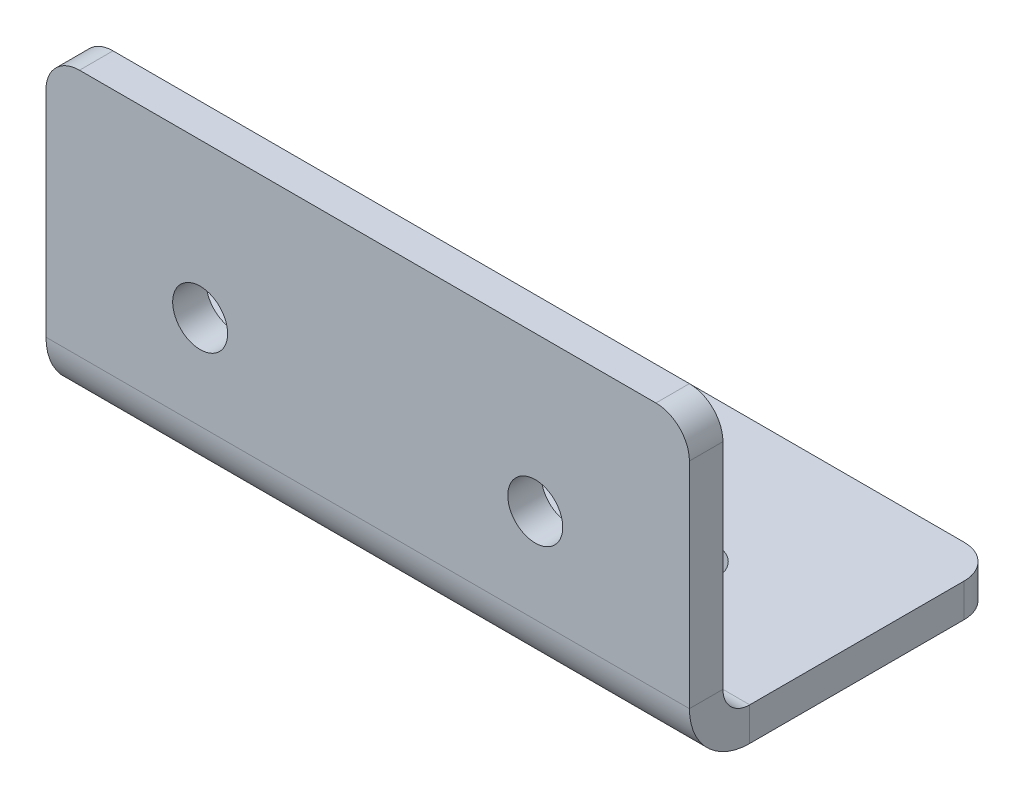
ISO-10303-21;
HEADER;
FILE_DESCRIPTION(('STEP AP214'),'2;1');
FILE_NAME('part.step','',(''),(''),'','','');
FILE_SCHEMA(('AUTOMOTIVE_DESIGN { 1 0 10303 214 1 1 1 1 }'));
ENDSEC;
DATA;
#1=APPLICATION_CONTEXT('core data for automotive mechanical design processes');
#2=APPLICATION_PROTOCOL_DEFINITION('international standard','automotive_design',2000,#1);
#3=PRODUCT_CONTEXT('',#1,'mechanical');
#4=PRODUCT('Part','Part','',(#3));
#5=PRODUCT_RELATED_PRODUCT_CATEGORY('part','',(#4));
#6=PRODUCT_DEFINITION_FORMATION('','',#4);
#7=PRODUCT_DEFINITION_CONTEXT('part definition',#1,'design');
#8=PRODUCT_DEFINITION('design','',#6,#7);
#9=PRODUCT_DEFINITION_SHAPE('','',#8);
#10=(LENGTH_UNIT() NAMED_UNIT(*) SI_UNIT(.MILLI.,.METRE.));
#11=(NAMED_UNIT(*) PLANE_ANGLE_UNIT() SI_UNIT($,.RADIAN.));
#12=(NAMED_UNIT(*) SI_UNIT($,.STERADIAN.) SOLID_ANGLE_UNIT());
#13=UNCERTAINTY_MEASURE_WITH_UNIT(LENGTH_MEASURE(1.E-05),#10,'distance_accuracy_value','');
#14=(GEOMETRIC_REPRESENTATION_CONTEXT(3) GLOBAL_UNCERTAINTY_ASSIGNED_CONTEXT((#13)) GLOBAL_UNIT_ASSIGNED_CONTEXT((#10,
#11,#12)) REPRESENTATION_CONTEXT('',''));
#15=CARTESIAN_POINT('',(0.,0.,0.));
#16=DIRECTION('',(0.,0.,1.));
#17=DIRECTION('',(1.,0.,0.));
#18=AXIS2_PLACEMENT_3D('',#15,#16,#17);
#19=CARTESIAN_POINT('',(47.2010112311505,-21.7016265865805,22.500826360304));
#20=DIRECTION('',(0.,1.,0.));
#21=DIRECTION('',(0.,0.,1.));
#22=AXIS2_PLACEMENT_3D('',#19,#20,#21);
#23=PLANE('',#22);
#24=DIRECTION('',(0.,0.,-1.));
#25=VECTOR('',#24,1.);
#26=CARTESIAN_POINT('',(-48.7989887688495,-21.7016265865805,22.500826360304));
#27=LINE('',#26,#25);
#28=CARTESIAN_POINT('',(-48.7989887688495,-21.7016265865805,13.500826360304));
#29=VERTEX_POINT('',#28);
#30=CARTESIAN_POINT('',(-48.7989887688495,-21.7016265865805,-18.499173639696));
#31=VERTEX_POINT('',#30);
#32=EDGE_CURVE('E150',#29,#31,#27,.T.);
#33=ORIENTED_EDGE('',*,*,#32,.T.);
#34=CARTESIAN_POINT('',(-43.7989887688495,-21.7016265865805,-18.499173639696));
#35=DIRECTION('',(0.,1.,0.));
#36=DIRECTION('',(0.,0.,1.));
#37=AXIS2_PLACEMENT_3D('',#34,#35,#36);
#38=CIRCLE('',#37,5.);
#39=CARTESIAN_POINT('',(-43.7989887688495,-21.7016265865805,-23.499173639696));
#40=VERTEX_POINT('',#39);
#41=EDGE_CURVE('E208',#31,#40,#38,.F.);
#42=ORIENTED_EDGE('',*,*,#41,.T.);
#43=DIRECTION('',(-1.,0.,0.));
#44=VECTOR('',#43,1.);
#45=CARTESIAN_POINT('',(47.2010112311505,-21.7016265865805,-23.499173639696));
#46=LINE('',#45,#44);
#47=CARTESIAN_POINT('',(42.2010112311505,-21.7016265865805,-23.499173639696));
#48=VERTEX_POINT('',#47);
#49=EDGE_CURVE('E177',#48,#40,#46,.T.);
#50=ORIENTED_EDGE('',*,*,#49,.F.);
#51=CARTESIAN_POINT('',(42.2010112311505,-21.7016265865805,-18.499173639696));
#52=DIRECTION('',(0.,1.,0.));
#53=DIRECTION('',(0.,0.,1.));
#54=AXIS2_PLACEMENT_3D('',#51,#52,#53);
#55=CIRCLE('',#54,5.);
#56=CARTESIAN_POINT('',(47.2010112311505,-21.7016265865805,-18.499173639696));
#57=VERTEX_POINT('',#56);
#58=EDGE_CURVE('E206',#48,#57,#55,.F.);
#59=ORIENTED_EDGE('',*,*,#58,.T.);
#60=DIRECTION('',(0.,0.,-1.));
#61=VECTOR('',#60,1.);
#62=CARTESIAN_POINT('',(47.2010112311505,-21.7016265865805,22.500826360304));
#63=LINE('',#62,#61);
#64=CARTESIAN_POINT('',(47.2010112311505,-21.7016265865805,13.500826360304));
#65=VERTEX_POINT('',#64);
#66=EDGE_CURVE('E136',#65,#57,#63,.T.);
#67=ORIENTED_EDGE('',*,*,#66,.F.);
#68=DIRECTION('',(-1.,0.,0.));
#69=VECTOR('',#68,1.);
#70=CARTESIAN_POINT('',(47.2010112311505,-21.7016265865805,13.500826360304));
#71=LINE('',#70,#69);
#72=EDGE_CURVE('E149',#65,#29,#71,.T.);
#73=ORIENTED_EDGE('',*,*,#72,.T.);
#74=EDGE_LOOP('',(#33,#42,#50,#59,#67,#73));
#75=FACE_BOUND('',#74,.T.);
#76=CARTESIAN_POINT('',(24.2010112311505,-21.7016265865805,-0.499173639695982));
#77=DIRECTION('',(0.,1.,0.));
#78=DIRECTION('',(0.,0.,1.));
#79=AXIS2_PLACEMENT_3D('',#76,#77,#78);
#80=CIRCLE('',#79,4.1);
#81=CARTESIAN_POINT('',(24.2010112311505,-21.7016265865805,3.60082636030402));
#82=VERTEX_POINT('',#81);
#83=EDGE_CURVE('E233',#82,#82,#80,.T.);
#84=ORIENTED_EDGE('',*,*,#83,.T.);
#85=EDGE_LOOP('',(#84));
#86=FACE_BOUND('',#85,.T.);
#87=CARTESIAN_POINT('',(-25.7989887688495,-21.7016265865805,-0.499173639695982));
#88=DIRECTION('',(0.,1.,0.));
#89=DIRECTION('',(0.,0.,1.));
#90=AXIS2_PLACEMENT_3D('',#87,#88,#89);
#91=CIRCLE('',#90,4.1);
#92=CARTESIAN_POINT('',(-25.7989887688495,-21.7016265865805,3.60082636030402));
#93=VERTEX_POINT('',#92);
#94=EDGE_CURVE('E245',#93,#93,#91,.F.);
#95=ORIENTED_EDGE('',*,*,#94,.F.);
#96=EDGE_LOOP('',(#95));
#97=FACE_BOUND('',#96,.T.);
#98=ADVANCED_FACE('F16',(#75,#86,#97),#23,.F.);
#99=CARTESIAN_POINT('',(47.2010112311505,-16.7016265865805,22.500826360304));
#100=DIRECTION('',(0.,1.,0.));
#101=DIRECTION('',(0.,0.,1.));
#102=AXIS2_PLACEMENT_3D('',#99,#100,#101);
#103=PLANE('',#102);
#104=DIRECTION('',(-1.,0.,0.));
#105=VECTOR('',#104,1.);
#106=CARTESIAN_POINT('',(47.2010112311505,-16.7016265865805,-23.499173639696));
#107=LINE('',#106,#105);
#108=CARTESIAN_POINT('',(42.2010112311505,-16.7016265865805,-23.499173639696));
#109=VERTEX_POINT('',#108);
#110=CARTESIAN_POINT('',(-43.7989887688495,-16.7016265865805,-23.499173639696));
#111=VERTEX_POINT('',#110);
#112=EDGE_CURVE('E132',#109,#111,#107,.T.);
#113=ORIENTED_EDGE('',*,*,#112,.T.);
#114=CARTESIAN_POINT('',(-43.7989887688495,-16.7016265865805,-18.499173639696));
#115=DIRECTION('',(0.,1.,0.));
#116=DIRECTION('',(0.,0.,1.));
#117=AXIS2_PLACEMENT_3D('',#114,#115,#116);
#118=CIRCLE('',#117,5.);
#119=CARTESIAN_POINT('',(-48.7989887688495,-16.7016265865805,-18.499173639696));
#120=VERTEX_POINT('',#119);
#121=EDGE_CURVE('E24',#111,#120,#118,.T.);
#122=ORIENTED_EDGE('',*,*,#121,.T.);
#123=DIRECTION('',(0.,0.,-1.));
#124=VECTOR('',#123,1.);
#125=CARTESIAN_POINT('',(-48.7989887688495,-16.7016265865805,22.500826360304));
#126=LINE('',#125,#124);
#127=CARTESIAN_POINT('',(-48.7989887688495,-16.7016265865805,13.500826360304));
#128=VERTEX_POINT('',#127);
#129=EDGE_CURVE('E128',#128,#120,#126,.T.);
#130=ORIENTED_EDGE('',*,*,#129,.F.);
#131=DIRECTION('',(-1.,0.,0.));
#132=VECTOR('',#131,1.);
#133=CARTESIAN_POINT('',(47.2010112311505,-16.7016265865805,13.500826360304));
#134=LINE('',#133,#132);
#135=CARTESIAN_POINT('',(47.2010112311505,-16.7016265865805,13.500826360304));
#136=VERTEX_POINT('',#135);
#137=EDGE_CURVE('E122',#136,#128,#134,.T.);
#138=ORIENTED_EDGE('',*,*,#137,.F.);
#139=DIRECTION('',(0.,0.,-1.));
#140=VECTOR('',#139,1.);
#141=CARTESIAN_POINT('',(47.2010112311505,-16.7016265865805,22.500826360304));
#142=LINE('',#141,#140);
#143=CARTESIAN_POINT('',(47.2010112311505,-16.7016265865805,-18.499173639696));
#144=VERTEX_POINT('',#143);
#145=EDGE_CURVE('E125',#136,#144,#142,.T.);
#146=ORIENTED_EDGE('',*,*,#145,.T.);
#147=CARTESIAN_POINT('',(42.2010112311505,-16.7016265865805,-18.499173639696));
#148=DIRECTION('',(0.,1.,0.));
#149=DIRECTION('',(0.,0.,1.));
#150=AXIS2_PLACEMENT_3D('',#147,#148,#149);
#151=CIRCLE('',#150,5.);
#152=EDGE_CURVE('E214',#144,#109,#151,.T.);
#153=ORIENTED_EDGE('',*,*,#152,.T.);
#154=EDGE_LOOP('',(#113,#122,#130,#138,#146,#153));
#155=FACE_BOUND('',#154,.T.);
#156=CARTESIAN_POINT('',(24.2010112311505,-16.7016265865805,-0.499173639695982));
#157=DIRECTION('',(0.,1.,0.));
#158=DIRECTION('',(0.,0.,1.));
#159=AXIS2_PLACEMENT_3D('',#156,#157,#158);
#160=CIRCLE('',#159,4.1);
#161=CARTESIAN_POINT('',(24.2010112311505,-16.7016265865805,3.60082636030402));
#162=VERTEX_POINT('',#161);
#163=EDGE_CURVE('E238',#162,#162,#160,.T.);
#164=ORIENTED_EDGE('',*,*,#163,.F.);
#165=EDGE_LOOP('',(#164));
#166=FACE_BOUND('',#165,.T.);
#167=CARTESIAN_POINT('',(-25.7989887688495,-16.7016265865805,-0.499173639695982));
#168=DIRECTION('',(0.,-1.,0.));
#169=DIRECTION('',(0.,0.,1.));
#170=AXIS2_PLACEMENT_3D('',#167,#168,#169);
#171=CIRCLE('',#170,4.1);
#172=CARTESIAN_POINT('',(-25.7989887688495,-16.7016265865805,3.60082636030402));
#173=VERTEX_POINT('',#172);
#174=EDGE_CURVE('E250',#173,#173,#171,.T.);
#175=ORIENTED_EDGE('',*,*,#174,.T.);
#176=EDGE_LOOP('',(#175));
#177=FACE_BOUND('',#176,.T.);
#178=ADVANCED_FACE('F123',(#155,#166,#177),#103,.T.);
#179=CARTESIAN_POINT('',(47.2010112311505,-21.7016265865805,17.500826360304));
#180=DIRECTION('',(0.,0.,-1.));
#181=DIRECTION('',(-1.,0.,0.));
#182=AXIS2_PLACEMENT_3D('',#179,#180,#181);
#183=PLANE('',#182);
#184=DIRECTION('',(-1.,0.,0.));
#185=VECTOR('',#184,1.);
#186=CARTESIAN_POINT('',(47.2010112311505,24.2983734134195,17.500826360304));
#187=LINE('',#186,#185);
#188=CARTESIAN_POINT('',(42.2010112311505,24.2983734134195,17.500826360304));
#189=VERTEX_POINT('',#188);
#190=CARTESIAN_POINT('',(-43.7989887688495,24.2983734134195,17.500826360304));
#191=VERTEX_POINT('',#190);
#192=EDGE_CURVE('E172',#189,#191,#187,.T.);
#193=ORIENTED_EDGE('',*,*,#192,.F.);
#194=CARTESIAN_POINT('',(42.2010112311505,19.2983734134195,17.500826360304));
#195=DIRECTION('',(0.,0.,-1.));
#196=DIRECTION('',(-1.,0.,0.));
#197=AXIS2_PLACEMENT_3D('',#194,#195,#196);
#198=CIRCLE('',#197,5.);
#199=CARTESIAN_POINT('',(47.2010112311505,19.2983734134195,17.500826360304));
#200=VERTEX_POINT('',#199);
#201=EDGE_CURVE('E192',#189,#200,#198,.T.);
#202=ORIENTED_EDGE('',*,*,#201,.T.);
#203=DIRECTION('',(0.,1.,0.));
#204=VECTOR('',#203,1.);
#205=CARTESIAN_POINT('',(47.2010112311505,-21.7016265865805,17.500826360304));
#206=LINE('',#205,#204);
#207=CARTESIAN_POINT('',(47.2010112311505,-12.7016265865805,17.500826360304));
#208=VERTEX_POINT('',#207);
#209=EDGE_CURVE('E141',#200,#208,#206,.F.);
#210=ORIENTED_EDGE('',*,*,#209,.T.);
#211=DIRECTION('',(-1.,0.,0.));
#212=VECTOR('',#211,1.);
#213=CARTESIAN_POINT('',(47.2010112311505,-12.7016265865805,17.500826360304));
#214=LINE('',#213,#212);
#215=CARTESIAN_POINT('',(-48.7989887688495,-12.7016265865805,17.500826360304));
#216=VERTEX_POINT('',#215);
#217=EDGE_CURVE('E133',#208,#216,#214,.T.);
#218=ORIENTED_EDGE('',*,*,#217,.T.);
#219=DIRECTION('',(0.,1.,0.));
#220=VECTOR('',#219,1.);
#221=CARTESIAN_POINT('',(-48.7989887688495,-21.7016265865805,17.500826360304));
#222=LINE('',#221,#220);
#223=CARTESIAN_POINT('',(-48.7989887688495,19.2983734134195,17.500826360304));
#224=VERTEX_POINT('',#223);
#225=EDGE_CURVE('E157',#224,#216,#222,.F.);
#226=ORIENTED_EDGE('',*,*,#225,.F.);
#227=CARTESIAN_POINT('',(-43.7989887688495,19.2983734134195,17.500826360304));
#228=DIRECTION('',(0.,0.,-1.));
#229=DIRECTION('',(-1.,0.,0.));
#230=AXIS2_PLACEMENT_3D('',#227,#228,#229);
#231=CIRCLE('',#230,5.);
#232=EDGE_CURVE('E190',#224,#191,#231,.T.);
#233=ORIENTED_EDGE('',*,*,#232,.T.);
#234=EDGE_LOOP('',(#193,#202,#210,#218,#226,#233));
#235=FACE_BOUND('',#234,.T.);
#236=CARTESIAN_POINT('',(24.2010112311505,1.29837341341954,17.500826360304));
#237=DIRECTION('',(0.,0.,-1.));
#238=DIRECTION('',(-1.,0.,0.));
#239=AXIS2_PLACEMENT_3D('',#236,#237,#238);
#240=CIRCLE('',#239,4.1);
#241=CARTESIAN_POINT('',(20.1010112311505,1.29837341341954,17.500826360304));
#242=VERTEX_POINT('',#241);
#243=EDGE_CURVE('E230',#242,#242,#240,.T.);
#244=ORIENTED_EDGE('',*,*,#243,.F.);
#245=EDGE_LOOP('',(#244));
#246=FACE_BOUND('',#245,.T.);
#247=CARTESIAN_POINT('',(-25.7989887688495,1.29837341341954,17.500826360304));
#248=DIRECTION('',(0.,0.,1.));
#249=DIRECTION('',(1.,0.,0.));
#250=AXIS2_PLACEMENT_3D('',#247,#248,#249);
#251=CIRCLE('',#250,4.1);
#252=CARTESIAN_POINT('',(-21.6989887688495,1.29837341341954,17.500826360304));
#253=VERTEX_POINT('',#252);
#254=EDGE_CURVE('E242',#253,#253,#251,.T.);
#255=ORIENTED_EDGE('',*,*,#254,.T.);
#256=EDGE_LOOP('',(#255));
#257=FACE_BOUND('',#256,.T.);
#258=ADVANCED_FACE('F268',(#235,#246,#257),#183,.T.);
#259=CARTESIAN_POINT('',(47.2010112311505,-21.7016265865805,22.500826360304));
#260=DIRECTION('',(0.,0.,-1.));
#261=DIRECTION('',(-1.,0.,0.));
#262=AXIS2_PLACEMENT_3D('',#259,#260,#261);
#263=PLANE('',#262);
#264=DIRECTION('',(0.,-1.,0.));
#265=VECTOR('',#264,1.);
#266=CARTESIAN_POINT('',(47.2010112311505,-21.7016265865805,22.500826360304));
#267=LINE('',#266,#265);
#268=CARTESIAN_POINT('',(47.2010112311505,19.2983734134195,22.500826360304));
#269=VERTEX_POINT('',#268);
#270=CARTESIAN_POINT('',(47.2010112311505,-12.7016265865805,22.500826360304));
#271=VERTEX_POINT('',#270);
#272=EDGE_CURVE('E143',#269,#271,#267,.T.);
#273=ORIENTED_EDGE('',*,*,#272,.F.);
#274=CARTESIAN_POINT('',(42.2010112311505,19.2983734134195,22.500826360304));
#275=DIRECTION('',(0.,0.,-1.));
#276=DIRECTION('',(-1.,0.,0.));
#277=AXIS2_PLACEMENT_3D('',#274,#275,#276);
#278=CIRCLE('',#277,5.);
#279=CARTESIAN_POINT('',(42.2010112311505,24.2983734134195,22.500826360304));
#280=VERTEX_POINT('',#279);
#281=EDGE_CURVE('E198',#269,#280,#278,.F.);
#282=ORIENTED_EDGE('',*,*,#281,.T.);
#283=DIRECTION('',(-1.,0.,0.));
#284=VECTOR('',#283,1.);
#285=CARTESIAN_POINT('',(47.2010112311505,24.2983734134195,22.500826360304));
#286=LINE('',#285,#284);
#287=CARTESIAN_POINT('',(-43.7989887688495,24.2983734134195,22.500826360304));
#288=VERTEX_POINT('',#287);
#289=EDGE_CURVE('E169',#280,#288,#286,.T.);
#290=ORIENTED_EDGE('',*,*,#289,.T.);
#291=CARTESIAN_POINT('',(-43.7989887688495,19.2983734134195,22.500826360304));
#292=DIRECTION('',(0.,0.,-1.));
#293=DIRECTION('',(-1.,0.,0.));
#294=AXIS2_PLACEMENT_3D('',#291,#292,#293);
#295=CIRCLE('',#294,5.);
#296=CARTESIAN_POINT('',(-48.7989887688495,19.2983734134195,22.500826360304));
#297=VERTEX_POINT('',#296);
#298=EDGE_CURVE('E196',#288,#297,#295,.F.);
#299=ORIENTED_EDGE('',*,*,#298,.T.);
#300=DIRECTION('',(0.,-1.,0.));
#301=VECTOR('',#300,1.);
#302=CARTESIAN_POINT('',(-48.7989887688495,-21.7016265865805,22.500826360304));
#303=LINE('',#302,#301);
#304=CARTESIAN_POINT('',(-48.7989887688495,-12.7016265865805,22.500826360304));
#305=VERTEX_POINT('',#304);
#306=EDGE_CURVE('E159',#297,#305,#303,.T.);
#307=ORIENTED_EDGE('',*,*,#306,.T.);
#308=DIRECTION('',(-1.,0.,0.));
#309=VECTOR('',#308,1.);
#310=CARTESIAN_POINT('',(47.2010112311505,-12.7016265865805,22.500826360304));
#311=LINE('',#310,#309);
#312=EDGE_CURVE('E166',#271,#305,#311,.T.);
#313=ORIENTED_EDGE('',*,*,#312,.F.);
#314=EDGE_LOOP('',(#273,#282,#290,#299,#307,#313));
#315=FACE_BOUND('',#314,.T.);
#316=CARTESIAN_POINT('',(24.2010112311505,1.29837341341954,22.500826360304));
#317=DIRECTION('',(0.,0.,-1.));
#318=DIRECTION('',(-1.,0.,0.));
#319=AXIS2_PLACEMENT_3D('',#316,#317,#318);
#320=CIRCLE('',#319,4.1);
#321=CARTESIAN_POINT('',(20.1010112311505,1.29837341341954,22.500826360304));
#322=VERTEX_POINT('',#321);
#323=EDGE_CURVE('E153',#322,#322,#320,.T.);
#324=ORIENTED_EDGE('',*,*,#323,.T.);
#325=EDGE_LOOP('',(#324));
#326=FACE_BOUND('',#325,.T.);
#327=CARTESIAN_POINT('',(-25.7989887688495,1.29837341341954,22.500826360304));
#328=DIRECTION('',(0.,0.,1.));
#329=DIRECTION('',(1.,0.,0.));
#330=AXIS2_PLACEMENT_3D('',#327,#328,#329);
#331=CIRCLE('',#330,4.1);
#332=CARTESIAN_POINT('',(-21.6989887688495,1.29837341341954,22.500826360304));
#333=VERTEX_POINT('',#332);
#334=EDGE_CURVE('E241',#333,#333,#331,.T.);
#335=ORIENTED_EDGE('',*,*,#334,.F.);
#336=EDGE_LOOP('',(#335));
#337=FACE_BOUND('',#336,.T.);
#338=ADVANCED_FACE('F284',(#315,#326,#337),#263,.F.);
#339=CARTESIAN_POINT('',(47.2010112311505,-12.7016265865805,22.500826360304));
#340=DIRECTION('',(1.,0.,0.));
#341=DIRECTION('',(0.,0.,-1.));
#342=AXIS2_PLACEMENT_3D('',#339,#340,#341);
#343=PLANE('',#342);
#344=DIRECTION('',(0.,0.,-1.));
#345=VECTOR('',#344,1.);
#346=CARTESIAN_POINT('',(47.2010112311505,-12.7016265865805,22.500826360304));
#347=LINE('',#346,#345);
#348=EDGE_CURVE('E116',#271,#208,#347,.T.);
#349=ORIENTED_EDGE('',*,*,#348,.F.);
#350=CARTESIAN_POINT('',(47.2010112311505,-12.7016265865805,13.500826360304));
#351=DIRECTION('',(-1.,0.,0.));
#352=DIRECTION('',(0.,0.,1.));
#353=AXIS2_PLACEMENT_3D('',#350,#351,#352);
#354=CIRCLE('',#353,9.);
#355=EDGE_CURVE('E114',#271,#65,#354,.F.);
#356=ORIENTED_EDGE('',*,*,#355,.T.);
#357=DIRECTION('',(0.,-1.,0.));
#358=VECTOR('',#357,1.);
#359=CARTESIAN_POINT('',(47.2010112311505,-16.7016265865805,13.500826360304));
#360=LINE('',#359,#358);
#361=EDGE_CURVE('E107',#136,#65,#360,.T.);
#362=ORIENTED_EDGE('',*,*,#361,.F.);
#363=CARTESIAN_POINT('',(47.2010112311505,-12.7016265865805,13.500826360304));
#364=DIRECTION('',(1.,0.,0.));
#365=DIRECTION('',(0.,0.,-1.));
#366=AXIS2_PLACEMENT_3D('',#363,#364,#365);
#367=CIRCLE('',#366,4.);
#368=EDGE_CURVE('E112',#208,#136,#367,.T.);
#369=ORIENTED_EDGE('',*,*,#368,.F.);
#370=EDGE_LOOP('',(#349,#356,#362,#369));
#371=FACE_BOUND('',#370,.T.);
#372=ADVANCED_FACE('F110',(#371),#343,.T.);
#373=CARTESIAN_POINT('',(47.2010112311505,-16.7016265865805,13.500826360304));
#374=DIRECTION('',(1.,0.,0.));
#375=DIRECTION('',(0.,0.,-1.));
#376=AXIS2_PLACEMENT_3D('',#373,#374,#375);
#377=PLANE('',#376);
#378=ORIENTED_EDGE('',*,*,#209,.F.);
#379=DIRECTION('',(0.,0.,-1.));
#380=VECTOR('',#379,1.);
#381=CARTESIAN_POINT('',(47.2010112311505,19.2983734134195,13.500826360304));
#382=LINE('',#381,#380);
#383=EDGE_CURVE('E194',#200,#269,#382,.F.);
#384=ORIENTED_EDGE('',*,*,#383,.T.);
#385=ORIENTED_EDGE('',*,*,#272,.T.);
#386=ORIENTED_EDGE('',*,*,#348,.T.);
#387=EDGE_LOOP('',(#378,#384,#385,#386));
#388=FACE_BOUND('',#387,.T.);
#389=ADVANCED_FACE('F277',(#388),#377,.T.);
#390=CARTESIAN_POINT('',(-48.7989887688495,-21.7016265865805,13.500826360304));
#391=DIRECTION('',(-1.,0.,0.));
#392=DIRECTION('',(0.,0.,1.));
#393=AXIS2_PLACEMENT_3D('',#390,#391,#392);
#394=PLANE('',#393);
#395=DIRECTION('',(0.,1.,0.));
#396=VECTOR('',#395,1.);
#397=CARTESIAN_POINT('',(-48.7989887688495,-21.7016265865805,13.500826360304));
#398=LINE('',#397,#396);
#399=EDGE_CURVE('E117',#29,#128,#398,.T.);
#400=ORIENTED_EDGE('',*,*,#399,.F.);
#401=CARTESIAN_POINT('',(-48.7989887688495,-12.7016265865805,13.500826360304));
#402=DIRECTION('',(-1.,0.,0.));
#403=DIRECTION('',(0.,0.,1.));
#404=AXIS2_PLACEMENT_3D('',#401,#402,#403);
#405=CIRCLE('',#404,9.);
#406=EDGE_CURVE('E161',#305,#29,#405,.F.);
#407=ORIENTED_EDGE('',*,*,#406,.F.);
#408=DIRECTION('',(0.,0.,1.));
#409=VECTOR('',#408,1.);
#410=CARTESIAN_POINT('',(-48.7989887688495,-12.7016265865805,17.500826360304));
#411=LINE('',#410,#409);
#412=EDGE_CURVE('E179',#216,#305,#411,.T.);
#413=ORIENTED_EDGE('',*,*,#412,.F.);
#414=CARTESIAN_POINT('',(-48.7989887688495,-12.7016265865805,13.500826360304));
#415=DIRECTION('',(1.,0.,0.));
#416=DIRECTION('',(0.,0.,-1.));
#417=AXIS2_PLACEMENT_3D('',#414,#415,#416);
#418=CIRCLE('',#417,4.);
#419=EDGE_CURVE('E155',#216,#128,#418,.T.);
#420=ORIENTED_EDGE('',*,*,#419,.T.);
#421=EDGE_LOOP('',(#400,#407,#413,#420));
#422=FACE_BOUND('',#421,.T.);
#423=ADVANCED_FACE('F274',(#422),#394,.T.);
#424=CARTESIAN_POINT('',(-48.7989887688495,-12.7016265865805,17.500826360304));
#425=DIRECTION('',(-1.,0.,0.));
#426=DIRECTION('',(0.,0.,1.));
#427=AXIS2_PLACEMENT_3D('',#424,#425,#426);
#428=PLANE('',#427);
#429=ORIENTED_EDGE('',*,*,#129,.T.);
#430=DIRECTION('',(0.,-1.,0.));
#431=VECTOR('',#430,1.);
#432=CARTESIAN_POINT('',(-48.7989887688495,-12.7016265865805,-18.499173639696));
#433=LINE('',#432,#431);
#434=EDGE_CURVE('E203',#120,#31,#433,.T.);
#435=ORIENTED_EDGE('',*,*,#434,.T.);
#436=ORIENTED_EDGE('',*,*,#32,.F.);
#437=ORIENTED_EDGE('',*,*,#399,.T.);
#438=EDGE_LOOP('',(#429,#435,#436,#437));
#439=FACE_BOUND('',#438,.T.);
#440=ADVANCED_FACE('F219',(#439),#428,.T.);
#441=CARTESIAN_POINT('',(47.2010112311505,-16.7016265865805,-23.499173639696));
#442=DIRECTION('',(0.,0.,-1.));
#443=DIRECTION('',(-1.,0.,0.));
#444=AXIS2_PLACEMENT_3D('',#441,#442,#443);
#445=PLANE('',#444);
#446=ORIENTED_EDGE('',*,*,#49,.T.);
#447=DIRECTION('',(0.,-1.,0.));
#448=VECTOR('',#447,1.);
#449=CARTESIAN_POINT('',(-43.7989887688495,-16.7016265865805,-23.499173639696));
#450=LINE('',#449,#448);
#451=EDGE_CURVE('E37',#40,#111,#450,.F.);
#452=ORIENTED_EDGE('',*,*,#451,.T.);
#453=ORIENTED_EDGE('',*,*,#112,.F.);
#454=DIRECTION('',(0.,-1.,0.));
#455=VECTOR('',#454,1.);
#456=CARTESIAN_POINT('',(42.2010112311505,-16.7016265865805,-23.499173639696));
#457=LINE('',#456,#455);
#458=EDGE_CURVE('E210',#109,#48,#457,.T.);
#459=ORIENTED_EDGE('',*,*,#458,.T.);
#460=EDGE_LOOP('',(#446,#452,#453,#459));
#461=FACE_BOUND('',#460,.T.);
#462=ADVANCED_FACE('F225',(#461),#445,.T.);
#463=CARTESIAN_POINT('',(47.2010112311505,-12.7016265865805,13.500826360304));
#464=DIRECTION('',(-1.,0.,0.));
#465=DIRECTION('',(0.,0.,1.));
#466=AXIS2_PLACEMENT_3D('',#463,#464,#465);
#467=CYLINDRICAL_SURFACE('',#466,4.);
#468=ORIENTED_EDGE('',*,*,#419,.F.);
#469=ORIENTED_EDGE('',*,*,#217,.F.);
#470=ORIENTED_EDGE('',*,*,#368,.T.);
#471=ORIENTED_EDGE('',*,*,#137,.T.);
#472=EDGE_LOOP('',(#468,#469,#470,#471));
#473=FACE_BOUND('',#472,.T.);
#474=ADVANCED_FACE('F139',(#473),#467,.F.);
#475=CARTESIAN_POINT('',(47.2010112311505,24.2983734134195,22.500826360304));
#476=DIRECTION('',(0.,1.,0.));
#477=DIRECTION('',(0.,0.,1.));
#478=AXIS2_PLACEMENT_3D('',#475,#476,#477);
#479=PLANE('',#478);
#480=ORIENTED_EDGE('',*,*,#289,.F.);
#481=DIRECTION('',(0.,0.,-1.));
#482=VECTOR('',#481,1.);
#483=CARTESIAN_POINT('',(42.2010112311505,24.2983734134195,22.500826360304));
#484=LINE('',#483,#482);
#485=EDGE_CURVE('E187',#280,#189,#484,.T.);
#486=ORIENTED_EDGE('',*,*,#485,.T.);
#487=ORIENTED_EDGE('',*,*,#192,.T.);
#488=DIRECTION('',(0.,0.,-1.));
#489=VECTOR('',#488,1.);
#490=CARTESIAN_POINT('',(-43.7989887688495,24.2983734134195,22.500826360304));
#491=LINE('',#490,#489);
#492=EDGE_CURVE('E185',#191,#288,#491,.F.);
#493=ORIENTED_EDGE('',*,*,#492,.T.);
#494=EDGE_LOOP('',(#480,#486,#487,#493));
#495=FACE_BOUND('',#494,.T.);
#496=ADVANCED_FACE('F322',(#495),#479,.T.);
#497=CARTESIAN_POINT('',(47.2010112311505,-12.7016265865805,13.500826360304));
#498=DIRECTION('',(-1.,0.,0.));
#499=DIRECTION('',(0.,0.,1.));
#500=AXIS2_PLACEMENT_3D('',#497,#498,#499);
#501=CYLINDRICAL_SURFACE('',#500,9.);
#502=ORIENTED_EDGE('',*,*,#406,.T.);
#503=ORIENTED_EDGE('',*,*,#72,.F.);
#504=ORIENTED_EDGE('',*,*,#355,.F.);
#505=ORIENTED_EDGE('',*,*,#312,.T.);
#506=EDGE_LOOP('',(#502,#503,#504,#505));
#507=FACE_BOUND('',#506,.T.);
#508=ADVANCED_FACE('F316',(#507),#501,.T.);
#509=CARTESIAN_POINT('',(47.2010112311505,-12.7016265865805,13.500826360304));
#510=DIRECTION('',(1.,0.,0.));
#511=DIRECTION('',(0.,0.,-1.));
#512=AXIS2_PLACEMENT_3D('',#509,#510,#511);
#513=PLANE('',#512);
#514=ORIENTED_EDGE('',*,*,#66,.T.);
#515=DIRECTION('',(0.,-1.,0.));
#516=VECTOR('',#515,1.);
#517=CARTESIAN_POINT('',(47.2010112311505,-12.7016265865805,-18.499173639696));
#518=LINE('',#517,#516);
#519=EDGE_CURVE('E10',#57,#144,#518,.F.);
#520=ORIENTED_EDGE('',*,*,#519,.T.);
#521=ORIENTED_EDGE('',*,*,#145,.F.);
#522=ORIENTED_EDGE('',*,*,#361,.T.);
#523=EDGE_LOOP('',(#514,#520,#521,#522));
#524=FACE_BOUND('',#523,.T.);
#525=ADVANCED_FACE('F135',(#524),#513,.T.);
#526=CARTESIAN_POINT('',(-48.7989887688495,-12.7016265865805,13.500826360304));
#527=DIRECTION('',(1.,0.,0.));
#528=DIRECTION('',(0.,0.,-1.));
#529=AXIS2_PLACEMENT_3D('',#526,#527,#528);
#530=PLANE('',#529);
#531=ORIENTED_EDGE('',*,*,#306,.F.);
#532=DIRECTION('',(0.,0.,-1.));
#533=VECTOR('',#532,1.);
#534=CARTESIAN_POINT('',(-48.7989887688495,19.2983734134195,17.500826360304));
#535=LINE('',#534,#533);
#536=EDGE_CURVE('E200',#297,#224,#535,.T.);
#537=ORIENTED_EDGE('',*,*,#536,.T.);
#538=ORIENTED_EDGE('',*,*,#225,.T.);
#539=ORIENTED_EDGE('',*,*,#412,.T.);
#540=EDGE_LOOP('',(#531,#537,#538,#539));
#541=FACE_BOUND('',#540,.T.);
#542=ADVANCED_FACE('F312',(#541),#530,.F.);
#543=CARTESIAN_POINT('',(24.2010112311505,1.29837341341954,22.500826360304));
#544=DIRECTION('',(0.,0.,-1.));
#545=DIRECTION('',(-1.,0.,0.));
#546=AXIS2_PLACEMENT_3D('',#543,#544,#545);
#547=CYLINDRICAL_SURFACE('',#546,4.1);
#548=ORIENTED_EDGE('',*,*,#323,.F.);
#549=EDGE_LOOP('',(#548));
#550=FACE_BOUND('',#549,.T.);
#551=ORIENTED_EDGE('',*,*,#243,.T.);
#552=EDGE_LOOP('',(#551));
#553=FACE_BOUND('',#552,.T.);
#554=ADVANCED_FACE('F308',(#550,#553),#547,.F.);
#555=CARTESIAN_POINT('',(24.2010112311505,-26.7016265865805,-0.499173639695982));
#556=DIRECTION('',(0.,1.,0.));
#557=DIRECTION('',(0.,0.,1.));
#558=AXIS2_PLACEMENT_3D('',#555,#556,#557);
#559=CYLINDRICAL_SURFACE('',#558,4.1);
#560=ORIENTED_EDGE('',*,*,#163,.T.);
#561=EDGE_LOOP('',(#560));
#562=FACE_BOUND('',#561,.T.);
#563=ORIENTED_EDGE('',*,*,#83,.F.);
#564=EDGE_LOOP('',(#563));
#565=FACE_BOUND('',#564,.T.);
#566=ADVANCED_FACE('F289',(#562,#565),#559,.F.);
#567=CARTESIAN_POINT('',(42.2010112311505,19.2983734134195,22.500826360304));
#568=DIRECTION('',(0.,0.,-1.));
#569=DIRECTION('',(-1.,0.,0.));
#570=AXIS2_PLACEMENT_3D('',#567,#568,#569);
#571=CYLINDRICAL_SURFACE('',#570,5.);
#572=ORIENTED_EDGE('',*,*,#281,.F.);
#573=ORIENTED_EDGE('',*,*,#383,.F.);
#574=ORIENTED_EDGE('',*,*,#201,.F.);
#575=ORIENTED_EDGE('',*,*,#485,.F.);
#576=EDGE_LOOP('',(#572,#573,#574,#575));
#577=FACE_BOUND('',#576,.T.);
#578=ADVANCED_FACE('F285',(#577),#571,.T.);
#579=CARTESIAN_POINT('',(-43.7989887688495,19.2983734134195,13.500826360304));
#580=DIRECTION('',(0.,0.,1.));
#581=DIRECTION('',(1.,0.,0.));
#582=AXIS2_PLACEMENT_3D('',#579,#580,#581);
#583=CYLINDRICAL_SURFACE('',#582,5.);
#584=ORIENTED_EDGE('',*,*,#298,.F.);
#585=ORIENTED_EDGE('',*,*,#492,.F.);
#586=ORIENTED_EDGE('',*,*,#232,.F.);
#587=ORIENTED_EDGE('',*,*,#536,.F.);
#588=EDGE_LOOP('',(#584,#585,#586,#587));
#589=FACE_BOUND('',#588,.T.);
#590=ADVANCED_FACE('F288',(#589),#583,.T.);
#591=CARTESIAN_POINT('',(-43.7989887688495,-12.7016265865805,-18.499173639696));
#592=DIRECTION('',(0.,-1.,0.));
#593=DIRECTION('',(0.,0.,-1.));
#594=AXIS2_PLACEMENT_3D('',#591,#592,#593);
#595=CYLINDRICAL_SURFACE('',#594,5.);
#596=ORIENTED_EDGE('',*,*,#121,.F.);
#597=ORIENTED_EDGE('',*,*,#451,.F.);
#598=ORIENTED_EDGE('',*,*,#41,.F.);
#599=ORIENTED_EDGE('',*,*,#434,.F.);
#600=EDGE_LOOP('',(#596,#597,#598,#599));
#601=FACE_BOUND('',#600,.T.);
#602=ADVANCED_FACE('F221',(#601),#595,.T.);
#603=CARTESIAN_POINT('',(42.2010112311505,-16.7016265865805,-18.499173639696));
#604=DIRECTION('',(0.,-1.,0.));
#605=DIRECTION('',(0.,0.,-1.));
#606=AXIS2_PLACEMENT_3D('',#603,#604,#605);
#607=CYLINDRICAL_SURFACE('',#606,5.);
#608=ORIENTED_EDGE('',*,*,#152,.F.);
#609=ORIENTED_EDGE('',*,*,#519,.F.);
#610=ORIENTED_EDGE('',*,*,#58,.F.);
#611=ORIENTED_EDGE('',*,*,#458,.F.);
#612=EDGE_LOOP('',(#608,#609,#610,#611));
#613=FACE_BOUND('',#612,.T.);
#614=ADVANCED_FACE('F18',(#613),#607,.T.);
#615=CARTESIAN_POINT('',(-25.7989887688495,1.29837341341954,22.500826360304));
#616=DIRECTION('',(0.,0.,-1.));
#617=DIRECTION('',(-1.,0.,0.));
#618=AXIS2_PLACEMENT_3D('',#615,#616,#617);
#619=CYLINDRICAL_SURFACE('',#618,4.1);
#620=ORIENTED_EDGE('',*,*,#334,.T.);
#621=EDGE_LOOP('',(#620));
#622=FACE_BOUND('',#621,.T.);
#623=ORIENTED_EDGE('',*,*,#254,.F.);
#624=EDGE_LOOP('',(#623));
#625=FACE_BOUND('',#624,.T.);
#626=ADVANCED_FACE('F258',(#622,#625),#619,.F.);
#627=CARTESIAN_POINT('',(-25.7989887688495,-26.7016265865805,-0.499173639695982));
#628=DIRECTION('',(0.,1.,0.));
#629=DIRECTION('',(0.,0.,1.));
#630=AXIS2_PLACEMENT_3D('',#627,#628,#629);
#631=CYLINDRICAL_SURFACE('',#630,4.1);
#632=ORIENTED_EDGE('',*,*,#174,.F.);
#633=EDGE_LOOP('',(#632));
#634=FACE_BOUND('',#633,.T.);
#635=ORIENTED_EDGE('',*,*,#94,.T.);
#636=EDGE_LOOP('',(#635));
#637=FACE_BOUND('',#636,.T.);
#638=ADVANCED_FACE('F255',(#634,#637),#631,.F.);
#639=CLOSED_SHELL('',(#98,#178,#258,#338,#372,#389,#423,#440,#462,#474,#496,#508,#525,#542,#554,
#566,#578,#590,#602,#614,#626,#638));
#640=MANIFOLD_SOLID_BREP('B1',#639);
#641=ADVANCED_BREP_SHAPE_REPRESENTATION('',(#18,#640),#14);
#642=SHAPE_DEFINITION_REPRESENTATION(#9,#641);
ENDSEC;
END-ISO-10303-21;
